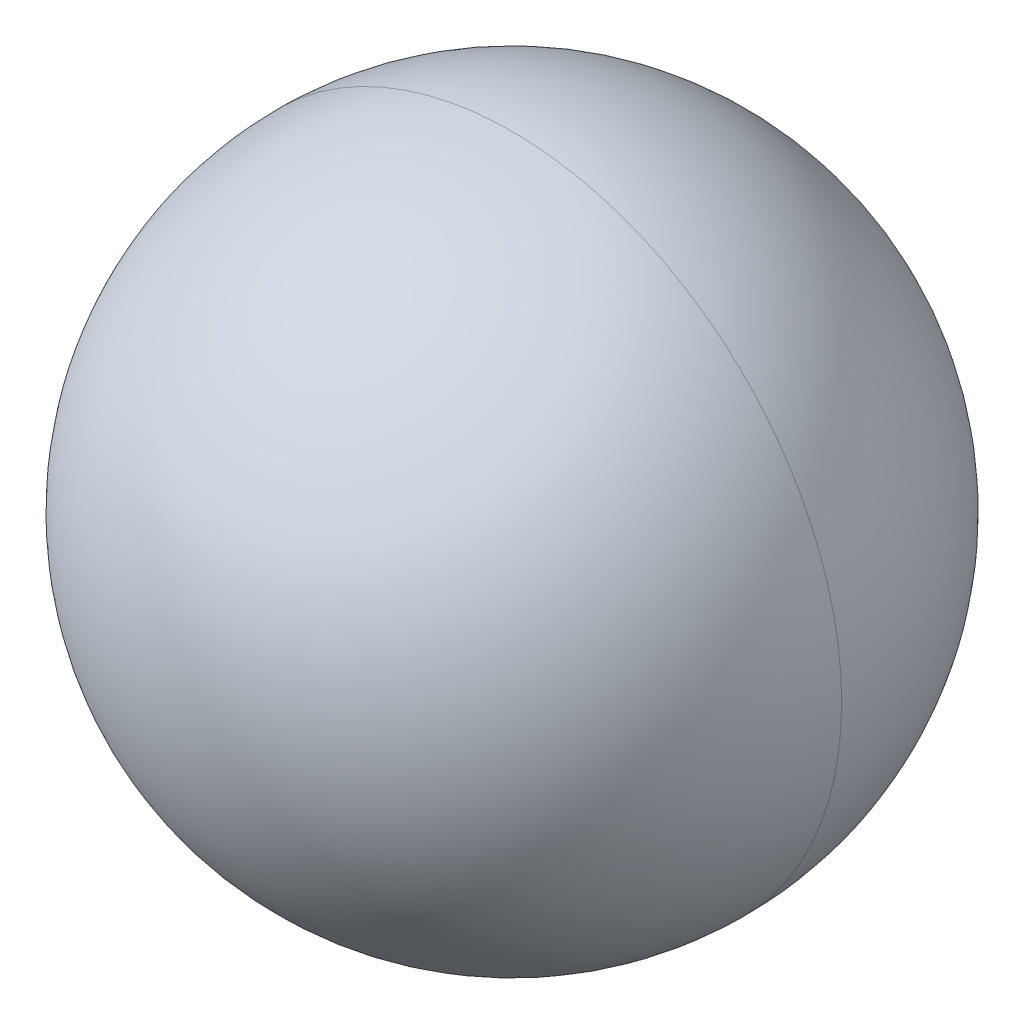
ISO-10303-21;
HEADER;
FILE_DESCRIPTION(('STEP AP214'),'2;1');
FILE_NAME('part.step','',(''),(''),'','','');
FILE_SCHEMA(('AUTOMOTIVE_DESIGN { 1 0 10303 214 1 1 1 1 }'));
ENDSEC;
DATA;
#1=APPLICATION_CONTEXT('core data for automotive mechanical design processes');
#2=APPLICATION_PROTOCOL_DEFINITION('international standard','automotive_design',2000,#1);
#3=PRODUCT_CONTEXT('',#1,'mechanical');
#4=PRODUCT('Part','Part','',(#3));
#5=PRODUCT_RELATED_PRODUCT_CATEGORY('part','',(#4));
#6=PRODUCT_DEFINITION_FORMATION('','',#4);
#7=PRODUCT_DEFINITION_CONTEXT('part definition',#1,'design');
#8=PRODUCT_DEFINITION('design','',#6,#7);
#9=PRODUCT_DEFINITION_SHAPE('','',#8);
#10=(LENGTH_UNIT() NAMED_UNIT(*) SI_UNIT(.MILLI.,.METRE.));
#11=(NAMED_UNIT(*) PLANE_ANGLE_UNIT() SI_UNIT($,.RADIAN.));
#12=(NAMED_UNIT(*) SI_UNIT($,.STERADIAN.) SOLID_ANGLE_UNIT());
#13=UNCERTAINTY_MEASURE_WITH_UNIT(LENGTH_MEASURE(1.E-05),#10,'distance_accuracy_value','');
#14=(GEOMETRIC_REPRESENTATION_CONTEXT(3) GLOBAL_UNCERTAINTY_ASSIGNED_CONTEXT((#13)) GLOBAL_UNIT_ASSIGNED_CONTEXT((#10,
#11,#12)) REPRESENTATION_CONTEXT('',''));
#15=CARTESIAN_POINT('',(0.,0.,0.));
#16=DIRECTION('',(0.,0.,1.));
#17=DIRECTION('',(1.,0.,0.));
#18=AXIS2_PLACEMENT_3D('',#15,#16,#17);
#19=CARTESIAN_POINT('',(6.,14.25,0.));
#20=DIRECTION('',(1.,0.,0.));
#21=DIRECTION('',(0.,0.,-1.));
#22=AXIS2_PLACEMENT_3D('',#19,#20,#21);
#23=SPHERICAL_SURFACE('',#22,3.572);
#24=CARTESIAN_POINT('',(6.,14.25,0.));
#25=DIRECTION('',(0.,0.,1.));
#26=DIRECTION('',(1.,0.,0.));
#27=AXIS2_PLACEMENT_3D('',#24,#25,#26);
#28=CIRCLE('',#27,3.572);
#29=CARTESIAN_POINT('',(9.572,14.25,0.));
#30=VERTEX_POINT('',#29);
#31=CARTESIAN_POINT('',(2.428,14.25,0.));
#32=VERTEX_POINT('',#31);
#33=EDGE_CURVE('E11',#30,#32,#28,.T.);
#34=ORIENTED_EDGE('',*,*,#33,.T.);
#35=CARTESIAN_POINT('',(6.,14.25,0.));
#36=DIRECTION('',(0.,0.,-1.));
#37=DIRECTION('',(1.,0.,0.));
#38=AXIS2_PLACEMENT_3D('',#35,#36,#37);
#39=CIRCLE('',#38,3.572);
#40=EDGE_CURVE('E24',#30,#32,#39,.T.);
#41=ORIENTED_EDGE('',*,*,#40,.F.);
#42=EDGE_LOOP('',(#34,#41));
#43=FACE_BOUND('',#42,.T.);
#44=ADVANCED_FACE('F16',(#43),#23,.T.);
#45=CARTESIAN_POINT('',(6.,14.25,0.));
#46=DIRECTION('',(1.,0.,0.));
#47=DIRECTION('',(0.,0.,1.));
#48=AXIS2_PLACEMENT_3D('',#45,#46,#47);
#49=SPHERICAL_SURFACE('',#48,3.572);
#50=ORIENTED_EDGE('',*,*,#33,.F.);
#51=ORIENTED_EDGE('',*,*,#40,.T.);
#52=EDGE_LOOP('',(#50,#51));
#53=FACE_BOUND('',#52,.T.);
#54=ADVANCED_FACE('F32',(#53),#49,.T.);
#55=CLOSED_SHELL('',(#44,#54));
#56=MANIFOLD_SOLID_BREP('B1',#55);
#57=ADVANCED_BREP_SHAPE_REPRESENTATION('',(#18,#56),#14);
#58=SHAPE_DEFINITION_REPRESENTATION(#9,#57);
ENDSEC;
END-ISO-10303-21;
